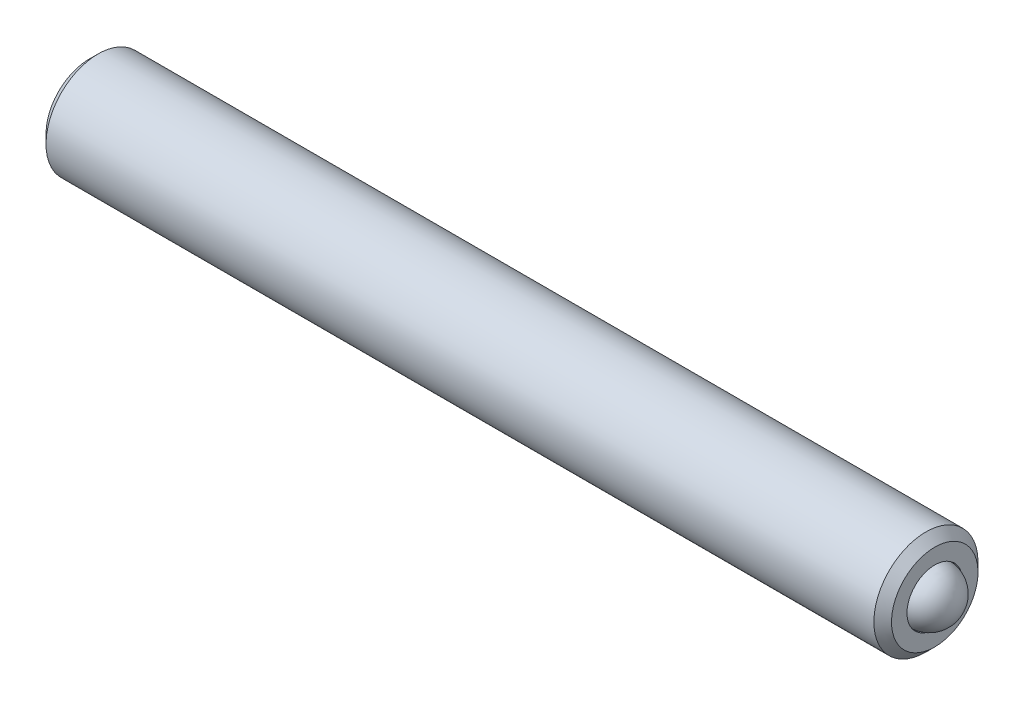
ISO-10303-21;
HEADER;
FILE_DESCRIPTION(('STEP AP214'),'2;1');
FILE_NAME('part.step','',(''),(''),'','','');
FILE_SCHEMA(('AUTOMOTIVE_DESIGN { 1 0 10303 214 1 1 1 1 }'));
ENDSEC;
DATA;
#1=APPLICATION_CONTEXT('core data for automotive mechanical design processes');
#2=APPLICATION_PROTOCOL_DEFINITION('international standard','automotive_design',2000,#1);
#3=PRODUCT_CONTEXT('',#1,'mechanical');
#4=PRODUCT('Part','Part','',(#3));
#5=PRODUCT_RELATED_PRODUCT_CATEGORY('part','',(#4));
#6=PRODUCT_DEFINITION_FORMATION('','',#4);
#7=PRODUCT_DEFINITION_CONTEXT('part definition',#1,'design');
#8=PRODUCT_DEFINITION('design','',#6,#7);
#9=PRODUCT_DEFINITION_SHAPE('','',#8);
#10=(LENGTH_UNIT() NAMED_UNIT(*) SI_UNIT(.MILLI.,.METRE.));
#11=(NAMED_UNIT(*) PLANE_ANGLE_UNIT() SI_UNIT($,.RADIAN.));
#12=(NAMED_UNIT(*) SI_UNIT($,.STERADIAN.) SOLID_ANGLE_UNIT());
#13=UNCERTAINTY_MEASURE_WITH_UNIT(LENGTH_MEASURE(1.E-05),#10,'distance_accuracy_value','');
#14=(GEOMETRIC_REPRESENTATION_CONTEXT(3) GLOBAL_UNCERTAINTY_ASSIGNED_CONTEXT((#13)) GLOBAL_UNIT_ASSIGNED_CONTEXT((#10,
#11,#12)) REPRESENTATION_CONTEXT('',''));
#15=CARTESIAN_POINT('',(0.,0.,0.));
#16=DIRECTION('',(0.,0.,1.));
#17=DIRECTION('',(1.,0.,0.));
#18=AXIS2_PLACEMENT_3D('',#15,#16,#17);
#19=CARTESIAN_POINT('',(-70.3789043052492,-10.8680182650171,24.548930342462));
#20=DIRECTION('',(-1.,0.,0.));
#21=DIRECTION('',(0.,-1.,0.));
#22=AXIS2_PLACEMENT_3D('',#19,#20,#21);
#23=PLANE('',#22);
#24=CARTESIAN_POINT('',(-70.3789043052492,8.8335284114578,24.548930342462));
#25=DIRECTION('',(-1.,0.,0.));
#26=DIRECTION('',(0.,0.,1.));
#27=AXIS2_PLACEMENT_3D('',#24,#25,#26);
#28=CIRCLE('',#27,0.952499999999995);
#29=CARTESIAN_POINT('',(-70.3789043052492,8.8335284114578,25.501430342462));
#30=VERTEX_POINT('',#29);
#31=EDGE_CURVE('P0_E229',#30,#30,#28,.T.);
#32=ORIENTED_EDGE('',*,*,#31,.F.);
#33=EDGE_LOOP('',(#32));
#34=FACE_BOUND('',#33,.T.);
#35=CARTESIAN_POINT('',(-70.3789043052492,8.8335284114578,24.548930342462));
#36=DIRECTION('',(-1.,0.,0.));
#37=DIRECTION('',(0.,-1.,0.));
#38=AXIS2_PLACEMENT_3D('',#35,#36,#37);
#39=CIRCLE('',#38,1.2446);
#40=CARTESIAN_POINT('',(-70.3789043052492,7.58892841145781,24.548930342462));
#41=VERTEX_POINT('',#40);
#42=EDGE_CURVE('P0_E102',#41,#41,#39,.T.);
#43=ORIENTED_EDGE('',*,*,#42,.T.);
#44=EDGE_LOOP('',(#43));
#45=FACE_BOUND('',#44,.T.);
#46=ADVANCED_FACE('P0_F17',(#34,#45),#23,.T.);
#47=CARTESIAN_POINT('',(-47.3269863203828,8.83352841145778,24.548930342462));
#48=DIRECTION('',(1.,0.,0.));
#49=DIRECTION('',(0.,1.,0.));
#50=AXIS2_PLACEMENT_3D('',#47,#48,#49);
#51=CONICAL_SURFACE('',#50,0.,0.785398163397454);
#52=CARTESIAN_POINT('',(-46.5268863203828,8.83352841145778,24.548930342462));
#53=DIRECTION('',(-1.,0.,0.));
#54=DIRECTION('',(0.,-1.,0.));
#55=AXIS2_PLACEMENT_3D('',#52,#53,#54);
#56=CIRCLE('',#55,0.800100000000008);
#57=CARTESIAN_POINT('',(-46.5268863203828,8.03342841145777,24.548930342462));
#58=VERTEX_POINT('',#57);
#59=EDGE_CURVE('P0_E29',#58,#58,#56,.T.);
#60=ORIENTED_EDGE('',*,*,#59,.F.);
#61=EDGE_LOOP('',(#60));
#62=FACE_BOUND('',#61,.T.);
#63=CARTESIAN_POINT('',(-47.3269863203828,8.83352841145778,24.548930342462));
#64=VERTEX_POINT('',#63);
#65=VERTEX_LOOP('',#64);
#66=FACE_BOUND('',#65,.T.);
#67=ADVANCED_FACE('P0_F121',(#62,#66),#51,.F.);
#68=CARTESIAN_POINT('',(-70.3789043052492,8.8335284114578,24.548930342462));
#69=DIRECTION('',(-1.,0.,0.));
#70=DIRECTION('',(0.,-1.,0.));
#71=AXIS2_PLACEMENT_3D('',#68,#69,#70);
#72=CYLINDRICAL_SURFACE('',#71,0.800100000000016);
#73=CARTESIAN_POINT('',(-46.0457043052492,8.83352841145778,24.548930342462));
#74=DIRECTION('',(-1.,0.,0.));
#75=DIRECTION('',(0.,-1.,0.));
#76=AXIS2_PLACEMENT_3D('',#73,#74,#75);
#77=CIRCLE('',#76,0.800100000000024);
#78=CARTESIAN_POINT('',(-46.0457043052492,8.03342841145776,24.548930342462));
#79=VERTEX_POINT('',#78);
#80=EDGE_CURVE('P0_E114',#79,#79,#77,.T.);
#81=ORIENTED_EDGE('',*,*,#80,.F.);
#82=EDGE_LOOP('',(#81));
#83=FACE_BOUND('',#82,.T.);
#84=ORIENTED_EDGE('',*,*,#59,.T.);
#85=EDGE_LOOP('',(#84));
#86=FACE_BOUND('',#85,.T.);
#87=ADVANCED_FACE('P0_F119',(#83,#86),#72,.F.);
#88=CARTESIAN_POINT('',(-46.0457043052492,-10.8680182650168,24.548930342462));
#89=DIRECTION('',(-1.,0.,0.));
#90=DIRECTION('',(0.,-1.,0.));
#91=AXIS2_PLACEMENT_3D('',#88,#89,#90);
#92=PLANE('',#91);
#93=CARTESIAN_POINT('',(-46.0457043052492,8.83352841145778,24.548930342462));
#94=DIRECTION('',(-1.,0.,0.));
#95=DIRECTION('',(0.,-1.,0.));
#96=AXIS2_PLACEMENT_3D('',#93,#94,#95);
#97=CIRCLE('',#96,1.24460000000001);
#98=CARTESIAN_POINT('',(-46.0457043052492,7.58892841145777,24.548930342462));
#99=VERTEX_POINT('',#98);
#100=EDGE_CURVE('P0_E111',#99,#99,#97,.T.);
#101=ORIENTED_EDGE('',*,*,#100,.F.);
#102=EDGE_LOOP('',(#101));
#103=FACE_BOUND('',#102,.T.);
#104=ORIENTED_EDGE('',*,*,#80,.T.);
#105=EDGE_LOOP('',(#104));
#106=FACE_BOUND('',#105,.T.);
#107=ADVANCED_FACE('P0_F128',(#103,#106),#92,.F.);
#108=CARTESIAN_POINT('',(-46.0457043052492,8.83352841145778,24.548930342462));
#109=DIRECTION('',(-1.,0.,0.));
#110=DIRECTION('',(0.,-1.,0.));
#111=AXIS2_PLACEMENT_3D('',#108,#109,#110);
#112=CONICAL_SURFACE('',#111,1.24460000000001,0.785398163397415);
#113=CARTESIAN_POINT('',(-46.2997043052492,8.83352841145778,24.548930342462));
#114=DIRECTION('',(-1.,0.,0.));
#115=DIRECTION('',(0.,-1.,0.));
#116=AXIS2_PLACEMENT_3D('',#113,#114,#115);
#117=CIRCLE('',#116,1.4986);
#118=CARTESIAN_POINT('',(-46.2997043052492,7.33492841145778,24.548930342462));
#119=VERTEX_POINT('',#118);
#120=EDGE_CURVE('P0_E108',#119,#119,#117,.T.);
#121=ORIENTED_EDGE('',*,*,#120,.F.);
#122=EDGE_LOOP('',(#121));
#123=FACE_BOUND('',#122,.T.);
#124=ORIENTED_EDGE('',*,*,#100,.T.);
#125=EDGE_LOOP('',(#124));
#126=FACE_BOUND('',#125,.T.);
#127=ADVANCED_FACE('P0_F135',(#123,#126),#112,.T.);
#128=CARTESIAN_POINT('',(-70.3789043052492,8.8335284114578,24.548930342462));
#129=DIRECTION('',(-1.,0.,0.));
#130=DIRECTION('',(0.,-1.,0.));
#131=AXIS2_PLACEMENT_3D('',#128,#129,#130);
#132=CYLINDRICAL_SURFACE('',#131,1.4986);
#133=CARTESIAN_POINT('',(-70.1249043052492,8.8335284114578,24.548930342462));
#134=DIRECTION('',(-1.,0.,0.));
#135=DIRECTION('',(0.,-1.,0.));
#136=AXIS2_PLACEMENT_3D('',#133,#134,#135);
#137=CIRCLE('',#136,1.4986);
#138=CARTESIAN_POINT('',(-70.1249043052492,7.3349284114578,24.548930342462));
#139=VERTEX_POINT('',#138);
#140=EDGE_CURVE('P0_E105',#139,#139,#137,.T.);
#141=ORIENTED_EDGE('',*,*,#140,.F.);
#142=EDGE_LOOP('',(#141));
#143=FACE_BOUND('',#142,.T.);
#144=ORIENTED_EDGE('',*,*,#120,.T.);
#145=EDGE_LOOP('',(#144));
#146=FACE_BOUND('',#145,.T.);
#147=ADVANCED_FACE('P0_F139',(#143,#146),#132,.T.);
#148=CARTESIAN_POINT('',(-70.3789043052492,8.8335284114578,24.548930342462));
#149=DIRECTION('',(1.,0.,0.));
#150=DIRECTION('',(0.,1.,0.));
#151=AXIS2_PLACEMENT_3D('',#148,#149,#150);
#152=CONICAL_SURFACE('',#151,1.2446,0.785398163397504);
#153=ORIENTED_EDGE('',*,*,#140,.T.);
#154=EDGE_LOOP('',(#153));
#155=FACE_BOUND('',#154,.T.);
#156=ORIENTED_EDGE('',*,*,#42,.F.);
#157=EDGE_LOOP('',(#156));
#158=FACE_BOUND('',#157,.T.);
#159=ADVANCED_FACE('P0_F143',(#155,#158),#152,.T.);
#160=CARTESIAN_POINT('',(-70.3789043052492,8.8335284114578,24.548930342462));
#161=DIRECTION('',(-1.,0.,0.));
#162=DIRECTION('',(0.,0.,1.));
#163=AXIS2_PLACEMENT_3D('',#160,#161,#162);
#164=CONICAL_SURFACE('',#163,0.952499999999995,0.78539816339745);
#165=CARTESIAN_POINT('',(-70.1758198019905,9.58294388151162,24.548730342462));
#166=CARTESIAN_POINT('',(-70.1629432188933,9.57005943995703,24.5710468498617));
#167=CARTESIAN_POINT('',(-70.1508212990274,9.5569603699558,24.5937351046357));
#168=CARTESIAN_POINT('',(-70.1286255345313,9.53024960735071,24.6399995025766));
#169=CARTESIAN_POINT('',(-70.1185640519323,9.51663536977904,24.6635800537571));
#170=CARTESIAN_POINT('',(-70.1013304822653,9.48918111240649,24.7111322224104));
#171=CARTESIAN_POINT('',(-70.0941149981618,9.47534812417641,24.7350916608454));
#172=CARTESIAN_POINT('',(-70.082988858373,9.44738419413134,24.7835266084628));
#173=CARTESIAN_POINT('',(-70.0790699157606,9.4332540915197,24.8080006641023));
#174=CARTESIAN_POINT('',(-70.0740979706983,9.39874018921399,24.8677804964633));
#175=CARTESIAN_POINT('',(-70.0749975068862,9.3782757729164,24.9032259052379));
#176=CARTESIAN_POINT('',(-70.0842660483065,9.33777589790244,24.9733737464623));
#177=CARTESIAN_POINT('',(-70.0926462075328,9.31774112550383,25.0080749901748));
#178=CARTESIAN_POINT('',(-70.1128552839194,9.28255607071271,25.0690172927401));
#179=CARTESIAN_POINT('',(-70.1236300068443,9.26724403024668,25.0955385247948));
#180=CARTESIAN_POINT('',(-70.1479029208111,9.23721991332529,25.147541820755));
#181=CARTESIAN_POINT('',(-70.161392252796,9.2225060677383,25.1730269488864));
#182=CARTESIAN_POINT('',(-70.1758198019905,9.20806294140397,25.1980431775176));
#183=B_SPLINE_CURVE_WITH_KNOTS('',3,(#165,#166,#167,#168,#169,#170,#171,#172,#173,#174,#175,
#176,#177,#178,#179,#180,#181,#182),.UNSPECIFIED.,.F.,.F.,(4,2,2,2,2,2,2,2,4),(0.,
0.0864788641253306,0.173462284806162,0.259062693136942,0.344447268473212,0.466486555643623,
0.588708114182797,0.685962692863689,0.782904885826097),.UNSPECIFIED.);
#184=CARTESIAN_POINT('',(-70.1757043052492,9.58282841145778,24.548930342462));
#185=VERTEX_POINT('',#184);
#186=CARTESIAN_POINT('',(-70.1757043052492,9.20817841145781,25.1978431775176));
#187=VERTEX_POINT('',#186);
#188=EDGE_CURVE('P0_E73',#185,#187,#183,.T.);
#189=ORIENTED_EDGE('',*,*,#188,.T.);
#190=CARTESIAN_POINT('',(-71.8879435241912,6.45906269073458,25.1978431775176));
#191=CARTESIAN_POINT('',(-71.8302010828783,6.51892777726854,25.1978431775176));
#192=CARTESIAN_POINT('',(-71.7725321490896,6.57886409814251,25.1978431775176));
#193=CARTESIAN_POINT('',(-71.6573903265642,6.69893084312873,25.1978431775176));
#194=CARTESIAN_POINT('',(-71.5999174484613,6.75906127743561,25.1978431775176));
#195=CARTESIAN_POINT('',(-71.4850636918786,6.87972881530995,25.1978431775176));
#196=CARTESIAN_POINT('',(-71.4276835121001,6.94026658448884,25.1978431775176));
#197=CARTESIAN_POINT('',(-71.3132581573738,7.06165351323088,25.1978431775176));
#198=CARTESIAN_POINT('',(-71.2562129687526,7.12250265989204,25.1978431775176));
#199=CARTESIAN_POINT('',(-71.1354279963014,7.25229181201308,25.1978431775176));
#200=CARTESIAN_POINT('',(-71.0717479438596,7.3212874862664,25.1978431775176));
#201=CARTESIAN_POINT('',(-70.9452005310698,7.46004072618967,25.1978431775176));
#202=CARTESIAN_POINT('',(-70.8823332834892,7.52979839515265,25.1978431775176));
#203=CARTESIAN_POINT('',(-70.7579718772946,7.67031993106539,25.1978431775176));
#204=CARTESIAN_POINT('',(-70.6964755832733,7.74108190425031,25.1978431775176));
#205=CARTESIAN_POINT('',(-70.575550518568,7.8843427817326,25.1978431775176));
#206=CARTESIAN_POINT('',(-70.5161211220825,7.9568411488701,25.1978431775176));
#207=CARTESIAN_POINT('',(-70.4238190111969,8.07555310219864,25.1978431775176));
#208=CARTESIAN_POINT('',(-70.3897391452055,8.12082202283153,25.1978431775176));
#209=CARTESIAN_POINT('',(-70.3236700054988,8.21301203639321,25.1978431775176));
#210=CARTESIAN_POINT('',(-70.2916846726037,8.25993600180435,25.1978431775176));
#211=CARTESIAN_POINT('',(-70.231831579273,8.35502156576147,25.1978431775176));
#212=CARTESIAN_POINT('',(-70.2038922307187,8.40313737077158,25.1978431775176));
#213=CARTESIAN_POINT('',(-70.1537554447551,8.50221793596643,25.1978431775176));
#214=CARTESIAN_POINT('',(-70.131535971778,8.55317081422633,25.1978431775176));
#215=CARTESIAN_POINT('',(-70.1034426994486,8.63804874663476,25.1978431775176));
#216=CARTESIAN_POINT('',(-70.0945701212995,8.67095370037624,25.1978431775176));
#217=CARTESIAN_POINT('',(-70.0815525225842,8.73762957705463,25.1978431775176));
#218=CARTESIAN_POINT('',(-70.0773945782904,8.77139787196044,25.1978431775176));
#219=CARTESIAN_POINT('',(-70.0741387279316,8.8468073642334,25.1978431775176));
#220=CARTESIAN_POINT('',(-70.076385319294,8.8885151941199,25.1978431775176));
#221=CARTESIAN_POINT('',(-70.0884311935834,8.97093045317073,25.1978431775176));
#222=CARTESIAN_POINT('',(-70.098263623979,9.01163268052793,25.1978431775176));
#223=CARTESIAN_POINT('',(-70.1209580840306,9.08296449352438,25.1978431775176));
#224=CARTESIAN_POINT('',(-70.1327814853741,9.1139443697868,25.1978431775176));
#225=CARTESIAN_POINT('',(-70.1590619940412,9.17477947491038,25.1978431775176));
#226=CARTESIAN_POINT('',(-70.1735212698733,9.20463375316589,25.1978431775176));
#227=CARTESIAN_POINT('',(-70.2044973464868,9.26361852783567,25.1978431775176));
#228=CARTESIAN_POINT('',(-70.2210332533479,9.29273881835768,25.1978431775176));
#229=CARTESIAN_POINT('',(-70.2555113174288,9.35010845322669,25.1978431775176));
#230=CARTESIAN_POINT('',(-70.2734528526113,9.37835817520333,25.1978431775176));
#231=CARTESIAN_POINT('',(-70.3153065248687,9.44161044537383,25.1978431775176));
#232=CARTESIAN_POINT('',(-70.3395341573004,9.47640297806983,25.1978431775176));
#233=CARTESIAN_POINT('',(-70.3891696165326,9.54513942718343,25.1978431775176));
#234=CARTESIAN_POINT('',(-70.4145777089632,9.57908314993046,25.1978431775176));
#235=CARTESIAN_POINT('',(-70.4921027064875,9.67999209717513,25.1978431775176));
#236=CARTESIAN_POINT('',(-70.5454838770445,9.74598238336363,25.1978431775176));
#237=CARTESIAN_POINT('',(-70.6543203525895,9.87658890582513,25.1978431775176));
#238=CARTESIAN_POINT('',(-70.709782167563,9.94119962733492,25.1978431775176));
#239=CARTESIAN_POINT('',(-70.8218808286849,10.0693395087274,25.1978431775176));
#240=CARTESIAN_POINT('',(-70.8785171288922,10.1328691471943,25.1978431775176));
#241=CARTESIAN_POINT('',(-70.9862735227875,10.2522190361072,25.1978431775176));
#242=CARTESIAN_POINT('',(-71.0373106219914,10.3081145638952,25.1978431775176));
#243=CARTESIAN_POINT('',(-71.1398495543572,10.4194915338596,25.1978431775176));
#244=CARTESIAN_POINT('',(-71.1913514502594,10.474972918229,25.1978431775176));
#245=CARTESIAN_POINT('',(-71.2943511767463,10.5852487207062,25.1978431775176));
#246=CARTESIAN_POINT('',(-71.3458467475459,10.6400452529106,25.1978431775176));
#247=CARTESIAN_POINT('',(-71.4490918709514,10.7493814513808,25.1978431775176));
#248=CARTESIAN_POINT('',(-71.5008413800465,10.8039211587154,25.1978431775176));
#249=CARTESIAN_POINT('',(-71.5526855338657,10.8583701325973,25.1978431775176));
#250=B_SPLINE_CURVE_WITH_KNOTS('',3,(#190,#191,#192,#193,#194,#195,#196,#197,#198,#199,#200,
#201,#202,#203,#204,#205,#206,#207,#208,#209,#210,#211,#212,#213,#214,#215,#216,#217,#218,#219,
#220,#221,#222,#223,#224,#225,#226,#227,#228,#229,#230,#231,#232,#233,#234,#235,#236,#237,#238,
#239,#240,#241,#242,#243,#244,#245,#246,#247,#248,#249),.UNSPECIFIED.,.F.,.F.,(4,2,2,2,2,2,2,2,
2,2,2,2,2,2,2,2,2,2,2,2,2,2,2,2,2,2,2,2,2,4),(0.,0.249524169444002,0.499061664048894,
0.749292126030612,0.999512302282469,1.28118188446105,1.56289013456254,1.8441236464603,
2.12527125365804,2.29522422452396,2.46548827885782,2.6322242235916,2.79830787351788,
2.90027530295205,3.00196253895408,3.12646325295121,3.2515110944402,3.35084711072828,
3.45026522165714,3.55067620712125,3.65104300569423,3.77819720424601,3.90538015527493,
4.15993807573814,4.41537266799776,4.67069107504115,4.89776066228886,5.12486137303353,
5.35044877312667,5.57599878315958),.UNSPECIFIED.);
#251=CARTESIAN_POINT('',(-70.1757043052492,8.4588784114578,25.1978431775176));
#252=VERTEX_POINT('',#251);
#253=EDGE_CURVE('P0_E87',#187,#252,#250,.F.);
#254=ORIENTED_EDGE('',*,*,#253,.T.);
#255=CARTESIAN_POINT('',(-70.1758198019905,8.45899388151164,25.1980431775176));
#256=CARTESIAN_POINT('',(-70.1629432188933,8.44610943995704,25.1757266701179));
#257=CARTESIAN_POINT('',(-70.1508212990274,8.43301036995581,25.1530384153439));
#258=CARTESIAN_POINT('',(-70.1286255345313,8.40629960735073,25.106774017403));
#259=CARTESIAN_POINT('',(-70.1185640519323,8.39268536977906,25.0831934662225));
#260=CARTESIAN_POINT('',(-70.1013304822653,8.3652311124065,25.0356412975692));
#261=CARTESIAN_POINT('',(-70.0941149981618,8.35139812417642,25.0116818591342));
#262=CARTESIAN_POINT('',(-70.082988858373,8.32343419413135,24.9632469115168));
#263=CARTESIAN_POINT('',(-70.0790699157606,8.30930409151971,24.9387728558773));
#264=CARTESIAN_POINT('',(-70.0740979706982,8.274790189214,24.8789930235163));
#265=CARTESIAN_POINT('',(-70.0749975068862,8.25432577291641,24.8435476147417));
#266=CARTESIAN_POINT('',(-70.0842660483065,8.21382589790245,24.7733997735173));
#267=CARTESIAN_POINT('',(-70.0926462075328,8.19379112550383,24.7386985298048));
#268=CARTESIAN_POINT('',(-70.1128552839194,8.15860607071272,24.6777562272395));
#269=CARTESIAN_POINT('',(-70.1236300068443,8.14329403024669,24.6512349951848));
#270=CARTESIAN_POINT('',(-70.1479029208111,8.11326991332531,24.5992316992246));
#271=CARTESIAN_POINT('',(-70.161392252796,8.09855606773832,24.5737465710932));
#272=CARTESIAN_POINT('',(-70.1758198019905,8.08411294140399,24.548730342462));
#273=B_SPLINE_CURVE_WITH_KNOTS('',3,(#255,#256,#257,#258,#259,#260,#261,#262,#263,#264,#265,
#266,#267,#268,#269,#270,#271,#272),.UNSPECIFIED.,.F.,.F.,(4,2,2,2,2,2,2,2,4),(0.,
0.0864788641253369,0.173462284806169,0.259062693136949,0.344447268473224,0.466486555643635,
0.588708114182814,0.685962692863695,0.7829048858261),.UNSPECIFIED.);
#274=CARTESIAN_POINT('',(-70.1757043052492,8.08422841145782,24.548930342462));
#275=VERTEX_POINT('',#274);
#276=EDGE_CURVE('P0_E184',#252,#275,#273,.T.);
#277=ORIENTED_EDGE('',*,*,#276,.T.);
#278=CARTESIAN_POINT('',(-70.1758198019905,8.45899388151164,23.8998175074063));
#279=CARTESIAN_POINT('',(-70.1629432188933,8.44610943995704,23.922134014806));
#280=CARTESIAN_POINT('',(-70.1508212990274,8.43301036995581,23.9448222695801));
#281=CARTESIAN_POINT('',(-70.1286255345313,8.40629960735072,23.991086667521));
#282=CARTESIAN_POINT('',(-70.1185640519323,8.39268536977906,24.0146672187014));
#283=CARTESIAN_POINT('',(-70.1013304822653,8.3652311124065,24.0622193873548));
#284=CARTESIAN_POINT('',(-70.0941149981618,8.35139812417642,24.0861788257898));
#285=CARTESIAN_POINT('',(-70.082988858373,8.32343419413135,24.1346137734071));
#286=CARTESIAN_POINT('',(-70.0790699157606,8.30930409151971,24.1590878290467));
#287=CARTESIAN_POINT('',(-70.0740979706982,8.27479018921399,24.2188676614076));
#288=CARTESIAN_POINT('',(-70.0749975068862,8.25432577291641,24.2543130701823));
#289=CARTESIAN_POINT('',(-70.0842660483065,8.21382589790245,24.3244609114067));
#290=CARTESIAN_POINT('',(-70.0926462075328,8.19379112550383,24.3591621551191));
#291=CARTESIAN_POINT('',(-70.1128552839194,8.15860607071272,24.4201044576844));
#292=CARTESIAN_POINT('',(-70.1236300068443,8.14329403024669,24.4466256897391));
#293=CARTESIAN_POINT('',(-70.1479029208111,8.11326991332531,24.4986289856994));
#294=CARTESIAN_POINT('',(-70.161392252796,8.09855606773832,24.5241141138308));
#295=CARTESIAN_POINT('',(-70.1758198019905,8.08411294140399,24.549130342462));
#296=B_SPLINE_CURVE_WITH_KNOTS('',3,(#278,#279,#280,#281,#282,#283,#284,#285,#286,#287,#288,
#289,#290,#291,#292,#293,#294,#295),.UNSPECIFIED.,.F.,.F.,(4,2,2,2,2,2,2,2,4),(0.,
0.0864788641253404,0.173462284806169,0.259062693136949,0.344447268473225,0.466486555643635,
0.588708114182815,0.685962692863695,0.7829048858261),.UNSPECIFIED.);
#297=CARTESIAN_POINT('',(-70.1757043052492,8.4588784114578,23.9000175074063));
#298=VERTEX_POINT('',#297);
#299=EDGE_CURVE('P0_E179',#298,#275,#296,.T.);
#300=ORIENTED_EDGE('',*,*,#299,.F.);
#301=CARTESIAN_POINT('',(-71.8879435241912,6.45906269073458,23.9000175074063));
#302=CARTESIAN_POINT('',(-71.8302010828783,6.51892777726854,23.9000175074063));
#303=CARTESIAN_POINT('',(-71.7725321490896,6.57886409814251,23.9000175074063));
#304=CARTESIAN_POINT('',(-71.6573903265642,6.69893084312873,23.9000175074063));
#305=CARTESIAN_POINT('',(-71.5999174484613,6.75906127743562,23.9000175074063));
#306=CARTESIAN_POINT('',(-71.4850636918786,6.87972881530996,23.9000175074063));
#307=CARTESIAN_POINT('',(-71.4276835121,6.94026658448885,23.9000175074063));
#308=CARTESIAN_POINT('',(-71.3132581573737,7.06165351323089,23.9000175074063));
#309=CARTESIAN_POINT('',(-71.2562129687526,7.12250265989205,23.9000175074063));
#310=CARTESIAN_POINT('',(-71.1354279963014,7.25229181201309,23.9000175074063));
#311=CARTESIAN_POINT('',(-71.0717479438596,7.32128748626641,23.9000175074063));
#312=CARTESIAN_POINT('',(-70.9452005310698,7.46004072618968,23.9000175074063));
#313=CARTESIAN_POINT('',(-70.8823332834892,7.52979839515265,23.9000175074063));
#314=CARTESIAN_POINT('',(-70.7579718772946,7.67031993106539,23.9000175074063));
#315=CARTESIAN_POINT('',(-70.6964755832733,7.74108190425031,23.9000175074063));
#316=CARTESIAN_POINT('',(-70.575550518568,7.88434278173259,23.9000175074063));
#317=CARTESIAN_POINT('',(-70.5161211220825,7.9568411488701,23.9000175074063));
#318=CARTESIAN_POINT('',(-70.4238190111969,8.07555310219864,23.9000175074063));
#319=CARTESIAN_POINT('',(-70.3897391452055,8.12082202283153,23.9000175074063));
#320=CARTESIAN_POINT('',(-70.3236700054988,8.21301203639321,23.9000175074063));
#321=CARTESIAN_POINT('',(-70.2916846726037,8.25993600180435,23.9000175074063));
#322=CARTESIAN_POINT('',(-70.231831579273,8.35502156576147,23.9000175074063));
#323=CARTESIAN_POINT('',(-70.2038922307187,8.40313737077158,23.9000175074063));
#324=CARTESIAN_POINT('',(-70.1537554447551,8.50221793596643,23.9000175074063));
#325=CARTESIAN_POINT('',(-70.131535971778,8.55317081422633,23.9000175074063));
#326=CARTESIAN_POINT('',(-70.1034426994486,8.63804874663476,23.9000175074063));
#327=CARTESIAN_POINT('',(-70.0945701212995,8.67095370037623,23.9000175074063));
#328=CARTESIAN_POINT('',(-70.0815525225842,8.73762957705463,23.9000175074063));
#329=CARTESIAN_POINT('',(-70.0773945782904,8.77139787196044,23.9000175074063));
#330=CARTESIAN_POINT('',(-70.0741387279316,8.8468073642334,23.9000175074063));
#331=CARTESIAN_POINT('',(-70.076385319294,8.8885151941199,23.9000175074063));
#332=CARTESIAN_POINT('',(-70.0884311935834,8.97093045317073,23.9000175074063));
#333=CARTESIAN_POINT('',(-70.098263623979,9.01163268052793,23.9000175074063));
#334=CARTESIAN_POINT('',(-70.1209580840306,9.08296449352438,23.9000175074063));
#335=CARTESIAN_POINT('',(-70.1327814853741,9.1139443697868,23.9000175074063));
#336=CARTESIAN_POINT('',(-70.1590619940412,9.17477947491038,23.9000175074063));
#337=CARTESIAN_POINT('',(-70.1735212698733,9.20463375316589,23.9000175074063));
#338=CARTESIAN_POINT('',(-70.2044973464868,9.26361852783567,23.9000175074063));
#339=CARTESIAN_POINT('',(-70.2210332533479,9.29273881835768,23.9000175074063));
#340=CARTESIAN_POINT('',(-70.2555113174288,9.35010845322669,23.9000175074063));
#341=CARTESIAN_POINT('',(-70.2734528526113,9.37835817520333,23.9000175074063));
#342=CARTESIAN_POINT('',(-70.3153065248687,9.44161044537383,23.9000175074063));
#343=CARTESIAN_POINT('',(-70.3395341573004,9.47640297806982,23.9000175074063));
#344=CARTESIAN_POINT('',(-70.3891696165326,9.54513942718343,23.9000175074063));
#345=CARTESIAN_POINT('',(-70.4145777089632,9.57908314993045,23.9000175074063));
#346=CARTESIAN_POINT('',(-70.4921027064876,9.67999209717512,23.9000175074063));
#347=CARTESIAN_POINT('',(-70.5454838770445,9.74598238336362,23.9000175074063));
#348=CARTESIAN_POINT('',(-70.6543203525895,9.87658890582512,23.9000175074063));
#349=CARTESIAN_POINT('',(-70.709782167563,9.94119962733492,23.9000175074063));
#350=CARTESIAN_POINT('',(-70.8218808286849,10.0693395087274,23.9000175074063));
#351=CARTESIAN_POINT('',(-70.8785171288922,10.1328691471943,23.9000175074063));
#352=CARTESIAN_POINT('',(-70.9862735227875,10.2522190361072,23.9000175074063));
#353=CARTESIAN_POINT('',(-71.0373106219914,10.3081145638952,23.9000175074063));
#354=CARTESIAN_POINT('',(-71.1398495543572,10.4194915338596,23.9000175074063));
#355=CARTESIAN_POINT('',(-71.1913514502594,10.474972918229,23.9000175074063));
#356=CARTESIAN_POINT('',(-71.2943511767463,10.5852487207062,23.9000175074063));
#357=CARTESIAN_POINT('',(-71.3458467475459,10.6400452529106,23.9000175074063));
#358=CARTESIAN_POINT('',(-71.4490918709514,10.7493814513808,23.9000175074063));
#359=CARTESIAN_POINT('',(-71.5008413800465,10.8039211587154,23.9000175074063));
#360=CARTESIAN_POINT('',(-71.5526855338657,10.8583701325973,23.9000175074063));
#361=B_SPLINE_CURVE_WITH_KNOTS('',3,(#301,#302,#303,#304,#305,#306,#307,#308,#309,#310,#311,
#312,#313,#314,#315,#316,#317,#318,#319,#320,#321,#322,#323,#324,#325,#326,#327,#328,#329,#330,
#331,#332,#333,#334,#335,#336,#337,#338,#339,#340,#341,#342,#343,#344,#345,#346,#347,#348,#349,
#350,#351,#352,#353,#354,#355,#356,#357,#358,#359,#360),.UNSPECIFIED.,.F.,.F.,(4,2,2,2,2,2,2,2,
2,2,2,2,2,2,2,2,2,2,2,2,2,2,2,2,2,2,2,2,2,4),(0.,0.249524169444014,0.499061664048901,
0.74929212603063,0.999512302282486,1.28118188446106,1.56289013456254,1.8441236464603,
2.12527125365803,2.29522422452395,2.46548827885782,2.6322242235916,2.79830787351788,
2.90027530295205,3.00196253895408,3.12646325295121,3.2515110944402,3.35084711072828,
3.45026522165714,3.55067620712125,3.65104300569423,3.77819720424601,3.90538015527492,
4.15993807573813,4.41537266799775,4.67069107504115,4.89776066228886,5.12486137303353,
5.35044877312667,5.57599878315958),.UNSPECIFIED.);
#362=CARTESIAN_POINT('',(-70.1757043052492,9.20817841145781,23.9000175074063));
#363=VERTEX_POINT('',#362);
#364=EDGE_CURVE('P0_E36',#363,#298,#361,.F.);
#365=ORIENTED_EDGE('',*,*,#364,.F.);
#366=CARTESIAN_POINT('',(-70.1758198019905,9.58294388151162,24.549130342462));
#367=CARTESIAN_POINT('',(-70.1629432188933,9.57005943995703,24.5268138350623));
#368=CARTESIAN_POINT('',(-70.1508212990274,9.55696036995579,24.5041255802882));
#369=CARTESIAN_POINT('',(-70.1286255345313,9.53024960735071,24.4578611823473));
#370=CARTESIAN_POINT('',(-70.1185640519323,9.51663536977904,24.4342806311669));
#371=CARTESIAN_POINT('',(-70.1013304822653,9.48918111240649,24.3867284625135));
#372=CARTESIAN_POINT('',(-70.0941149981618,9.47534812417641,24.3627690240785));
#373=CARTESIAN_POINT('',(-70.082988858373,9.44738419413134,24.3143340764612));
#374=CARTESIAN_POINT('',(-70.0790699157606,9.4332540915197,24.2898600208216));
#375=CARTESIAN_POINT('',(-70.0740979706982,9.39874018921399,24.2300801884607));
#376=CARTESIAN_POINT('',(-70.0749975068862,9.3782757729164,24.194634779686));
#377=CARTESIAN_POINT('',(-70.0842660483065,9.33777589790244,24.1244869384616));
#378=CARTESIAN_POINT('',(-70.0926462075328,9.31774112550383,24.0897856947492));
#379=CARTESIAN_POINT('',(-70.1128552839194,9.28255607071271,24.0288433921839));
#380=CARTESIAN_POINT('',(-70.1236300068443,9.26724403024668,24.0023221601291));
#381=CARTESIAN_POINT('',(-70.1479029208111,9.23721991332529,23.9503188641689));
#382=CARTESIAN_POINT('',(-70.161392252796,9.2225060677383,23.9248337360375));
#383=CARTESIAN_POINT('',(-70.1758198019905,9.20806294140397,23.8998175074063));
#384=B_SPLINE_CURVE_WITH_KNOTS('',3,(#366,#367,#368,#369,#370,#371,#372,#373,#374,#375,#376,
#377,#378,#379,#380,#381,#382,#383),.UNSPECIFIED.,.F.,.F.,(4,2,2,2,2,2,2,2,4),(0.,
0.086478864125335,0.173462284806159,0.259062693136939,0.344447268473212,0.46648655564362,
0.5887081141828,0.685962692863692,0.7829048858261),.UNSPECIFIED.);
#385=EDGE_CURVE('P0_E11',#185,#363,#384,.T.);
#386=ORIENTED_EDGE('',*,*,#385,.F.);
#387=EDGE_LOOP('',(#189,#254,#277,#300,#365,#386));
#388=FACE_BOUND('',#387,.T.);
#389=ORIENTED_EDGE('',*,*,#31,.T.);
#390=EDGE_LOOP('',(#389));
#391=FACE_BOUND('',#390,.T.);
#392=ADVANCED_FACE('P0_F71',(#388,#391),#164,.F.);
#393=CARTESIAN_POINT('',(-67.3309043052492,5.9539870552205,24.548930342462));
#394=DIRECTION('',(-1.,0.,0.));
#395=DIRECTION('',(0.,-1.,0.));
#396=AXIS2_PLACEMENT_3D('',#393,#394,#395);
#397=PLANE('',#396);
#398=DIRECTION('',(0.,-0.499999999999985,0.866025403784447));
#399=VECTOR('',#398,1.);
#400=CARTESIAN_POINT('',(-67.3309043052492,8.67561807239851,26.1202647428645));
#401=LINE('',#400,#399);
#402=CARTESIAN_POINT('',(-67.3309043052492,9.58282841145778,24.548930342462));
#403=VERTEX_POINT('',#402);
#404=CARTESIAN_POINT('',(-67.3309043052492,9.2081784114578,25.1978431775176));
#405=VERTEX_POINT('',#404);
#406=EDGE_CURVE('P0_E86',#403,#405,#401,.T.);
#407=ORIENTED_EDGE('',*,*,#406,.F.);
#408=DIRECTION('',(0.,-0.499999999999985,-0.866025403784447));
#409=VECTOR('',#408,1.);
#410=CARTESIAN_POINT('',(-67.3309043052492,8.67561807239851,22.9775959420595));
#411=LINE('',#410,#409);
#412=CARTESIAN_POINT('',(-67.3309043052492,9.2081784114578,23.9000175074063));
#413=VERTEX_POINT('',#412);
#414=EDGE_CURVE('P0_E92',#403,#413,#411,.T.);
#415=ORIENTED_EDGE('',*,*,#414,.T.);
#416=DIRECTION('',(0.,-1.,0.));
#417=VECTOR('',#416,1.);
#418=CARTESIAN_POINT('',(-67.3309043052492,5.9539870552205,23.9000175074063));
#419=LINE('',#418,#417);
#420=CARTESIAN_POINT('',(-67.3309043052492,8.4588784114578,23.9000175074063));
#421=VERTEX_POINT('',#420);
#422=EDGE_CURVE('P0_E208',#413,#421,#419,.T.);
#423=ORIENTED_EDGE('',*,*,#422,.T.);
#424=DIRECTION('',(0.,-0.499999999999985,0.866025403784447));
#425=VECTOR('',#424,1.);
#426=CARTESIAN_POINT('',(-67.3309043052492,7.55166807239852,25.4713519078088));
#427=LINE('',#426,#425);
#428=CARTESIAN_POINT('',(-67.3309043052492,8.08422841145782,24.548930342462));
#429=VERTEX_POINT('',#428);
#430=EDGE_CURVE('P0_E212',#421,#429,#427,.T.);
#431=ORIENTED_EDGE('',*,*,#430,.T.);
#432=DIRECTION('',(0.,-0.499999999999985,-0.866025403784447));
#433=VECTOR('',#432,1.);
#434=CARTESIAN_POINT('',(-67.3309043052492,7.55166807239852,23.6265087771151));
#435=LINE('',#434,#433);
#436=CARTESIAN_POINT('',(-67.3309043052492,8.4588784114578,25.1978431775176));
#437=VERTEX_POINT('',#436);
#438=EDGE_CURVE('P0_E98',#437,#429,#435,.T.);
#439=ORIENTED_EDGE('',*,*,#438,.F.);
#440=DIRECTION('',(0.,-1.,0.));
#441=VECTOR('',#440,1.);
#442=CARTESIAN_POINT('',(-67.3309043052492,5.9539870552205,25.1978431775176));
#443=LINE('',#442,#441);
#444=EDGE_CURVE('P0_E94',#405,#437,#443,.T.);
#445=ORIENTED_EDGE('',*,*,#444,.F.);
#446=EDGE_LOOP('',(#407,#415,#423,#431,#439,#445));
#447=FACE_BOUND('',#446,.T.);
#448=ADVANCED_FACE('P0_F167',(#447),#397,.T.);
#449=CARTESIAN_POINT('',(-67.3309043052492,8.67561807239851,22.9775959420595));
#450=DIRECTION('',(0.,0.866025403784447,-0.499999999999985));
#451=DIRECTION('',(0.,0.499999999999985,0.866025403784447));
#452=AXIS2_PLACEMENT_3D('',#449,#450,#451);
#453=PLANE('',#452);
#454=DIRECTION('',(-1.,0.,0.));
#455=VECTOR('',#454,1.);
#456=CARTESIAN_POINT('',(-67.3309043052492,9.58282841145778,24.548930342462));
#457=LINE('',#456,#455);
#458=EDGE_CURVE('P0_E82',#403,#185,#457,.T.);
#459=ORIENTED_EDGE('',*,*,#458,.T.);
#460=ORIENTED_EDGE('',*,*,#385,.T.);
#461=DIRECTION('',(-1.,0.,0.));
#462=VECTOR('',#461,1.);
#463=CARTESIAN_POINT('',(-67.3309043052492,9.2081784114578,23.9000175074063));
#464=LINE('',#463,#462);
#465=EDGE_CURVE('P0_E93',#413,#363,#464,.T.);
#466=ORIENTED_EDGE('',*,*,#465,.F.);
#467=ORIENTED_EDGE('',*,*,#414,.F.);
#468=EDGE_LOOP('',(#459,#460,#466,#467));
#469=FACE_BOUND('',#468,.T.);
#470=ADVANCED_FACE('P0_F90',(#469),#453,.F.);
#471=CARTESIAN_POINT('',(-67.3309043052492,5.9539870552205,23.9000175074063));
#472=DIRECTION('',(0.,0.,-1.));
#473=DIRECTION('',(-1.,0.,0.));
#474=AXIS2_PLACEMENT_3D('',#471,#472,#473);
#475=PLANE('',#474);
#476=ORIENTED_EDGE('',*,*,#465,.T.);
#477=ORIENTED_EDGE('',*,*,#364,.T.);
#478=DIRECTION('',(-1.,0.,0.));
#479=VECTOR('',#478,1.);
#480=CARTESIAN_POINT('',(-67.3309043052492,8.4588784114578,23.9000175074063));
#481=LINE('',#480,#479);
#482=EDGE_CURVE('P0_E96',#421,#298,#481,.T.);
#483=ORIENTED_EDGE('',*,*,#482,.F.);
#484=ORIENTED_EDGE('',*,*,#422,.F.);
#485=EDGE_LOOP('',(#476,#477,#483,#484));
#486=FACE_BOUND('',#485,.T.);
#487=ADVANCED_FACE('P0_F197',(#486),#475,.F.);
#488=CARTESIAN_POINT('',(-67.3309043052492,7.55166807239852,25.4713519078088));
#489=DIRECTION('',(0.,-0.866025403784447,-0.499999999999985));
#490=DIRECTION('',(0.,0.499999999999985,-0.866025403784447));
#491=AXIS2_PLACEMENT_3D('',#488,#489,#490);
#492=PLANE('',#491);
#493=ORIENTED_EDGE('',*,*,#482,.T.);
#494=ORIENTED_EDGE('',*,*,#299,.T.);
#495=DIRECTION('',(-1.,0.,0.));
#496=VECTOR('',#495,1.);
#497=CARTESIAN_POINT('',(-67.3309043052492,8.08422841145782,24.548930342462));
#498=LINE('',#497,#496);
#499=EDGE_CURVE('P0_E221',#429,#275,#498,.T.);
#500=ORIENTED_EDGE('',*,*,#499,.F.);
#501=ORIENTED_EDGE('',*,*,#430,.F.);
#502=EDGE_LOOP('',(#493,#494,#500,#501));
#503=FACE_BOUND('',#502,.T.);
#504=ADVANCED_FACE('P0_F192',(#503),#492,.F.);
#505=CARTESIAN_POINT('',(-67.3309043052492,7.55166807239852,23.6265087771151));
#506=DIRECTION('',(0.,0.866025403784447,-0.499999999999985));
#507=DIRECTION('',(0.,0.499999999999985,0.866025403784447));
#508=AXIS2_PLACEMENT_3D('',#505,#506,#507);
#509=PLANE('',#508);
#510=ORIENTED_EDGE('',*,*,#276,.F.);
#511=DIRECTION('',(-1.,0.,0.));
#512=VECTOR('',#511,1.);
#513=CARTESIAN_POINT('',(-67.3309043052492,8.4588784114578,25.1978431775176));
#514=LINE('',#513,#512);
#515=EDGE_CURVE('P0_E218',#437,#252,#514,.T.);
#516=ORIENTED_EDGE('',*,*,#515,.F.);
#517=ORIENTED_EDGE('',*,*,#438,.T.);
#518=ORIENTED_EDGE('',*,*,#499,.T.);
#519=EDGE_LOOP('',(#510,#516,#517,#518));
#520=FACE_BOUND('',#519,.T.);
#521=ADVANCED_FACE('P0_F189',(#520),#509,.T.);
#522=CARTESIAN_POINT('',(-67.3309043052492,5.9539870552205,25.1978431775176));
#523=DIRECTION('',(0.,0.,-1.));
#524=DIRECTION('',(-1.,0.,0.));
#525=AXIS2_PLACEMENT_3D('',#522,#523,#524);
#526=PLANE('',#525);
#527=ORIENTED_EDGE('',*,*,#253,.F.);
#528=DIRECTION('',(-1.,0.,0.));
#529=VECTOR('',#528,1.);
#530=CARTESIAN_POINT('',(-67.3309043052492,9.2081784114578,25.1978431775176));
#531=LINE('',#530,#529);
#532=EDGE_CURVE('P0_E85',#405,#187,#531,.T.);
#533=ORIENTED_EDGE('',*,*,#532,.F.);
#534=ORIENTED_EDGE('',*,*,#444,.T.);
#535=ORIENTED_EDGE('',*,*,#515,.T.);
#536=EDGE_LOOP('',(#527,#533,#534,#535));
#537=FACE_BOUND('',#536,.T.);
#538=ADVANCED_FACE('P0_F150',(#537),#526,.T.);
#539=CARTESIAN_POINT('',(-67.3309043052492,8.67561807239851,26.1202647428645));
#540=DIRECTION('',(0.,-0.866025403784447,-0.499999999999985));
#541=DIRECTION('',(0.,0.499999999999985,-0.866025403784447));
#542=AXIS2_PLACEMENT_3D('',#539,#540,#541);
#543=PLANE('',#542);
#544=ORIENTED_EDGE('',*,*,#188,.F.);
#545=ORIENTED_EDGE('',*,*,#458,.F.);
#546=ORIENTED_EDGE('',*,*,#406,.T.);
#547=ORIENTED_EDGE('',*,*,#532,.T.);
#548=EDGE_LOOP('',(#544,#545,#546,#547));
#549=FACE_BOUND('',#548,.T.);
#550=ADVANCED_FACE('P0_F80',(#549),#543,.T.);
#551=CLOSED_SHELL('',(#46,#67,#87,#107,#127,#147,#159,#392,#448,#470,#487,#504,#521,#538,#550));
#552=MANIFOLD_SOLID_BREP('P0_B1',#551);
#553=CARTESIAN_POINT('',(-46.2044543052492,8.83352841145778,24.548930342462));
#554=DIRECTION('',(-1.,0.,0.));
#555=DIRECTION('',(0.,1.,0.));
#556=AXIS2_PLACEMENT_3D('',#553,#554,#555);
#557=SPHERICAL_SURFACE('',#556,0.79375000000001);
#558=CARTESIAN_POINT('',(-46.9982043052492,8.83352841145778,24.548930342462));
#559=VERTEX_POINT('',#558);
#560=VERTEX_LOOP('',#559);
#561=FACE_BOUND('',#560,.T.);
#562=ADVANCED_FACE('P1_F12',(#561),#557,.T.);
#563=CLOSED_SHELL('',(#562));
#564=MANIFOLD_SOLID_BREP('P1_B1',#563);
#565=ADVANCED_BREP_SHAPE_REPRESENTATION('',(#18,#552,#564),#14);
#566=SHAPE_DEFINITION_REPRESENTATION(#9,#565);
ENDSEC;
END-ISO-10303-21;
